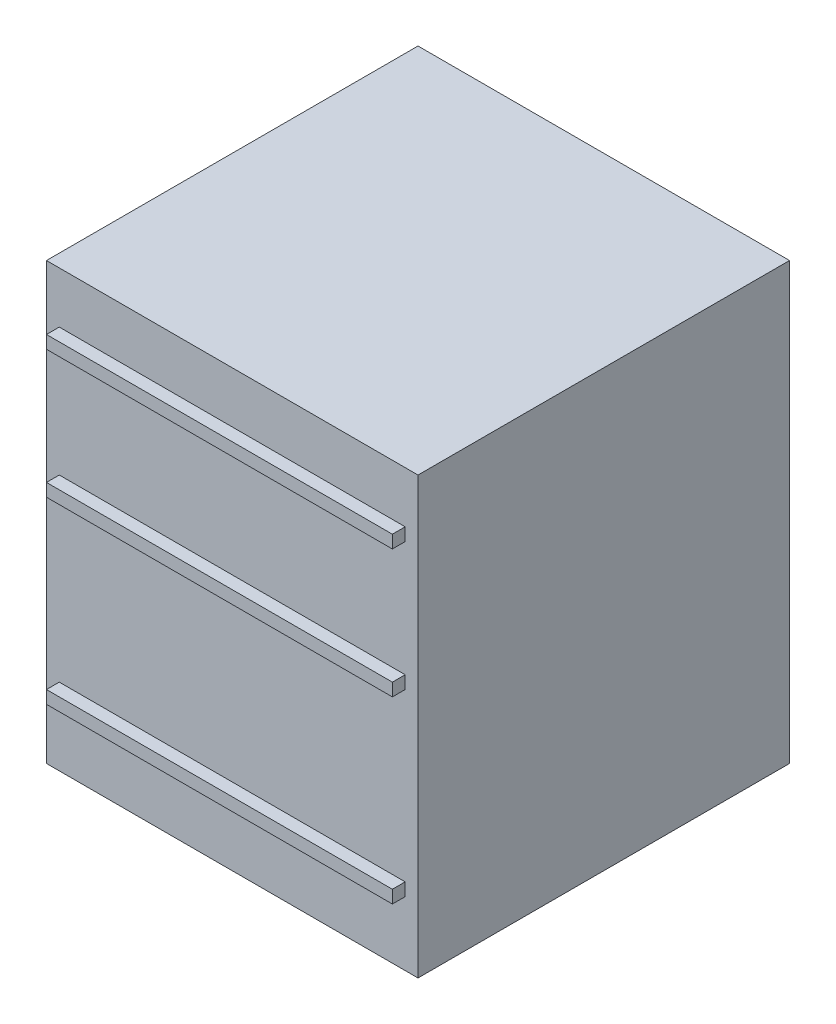
ISO-10303-21;
HEADER;
FILE_DESCRIPTION(('STEP AP214'),'2;1');
FILE_NAME('part.step','',(''),(''),'','','');
FILE_SCHEMA(('AUTOMOTIVE_DESIGN { 1 0 10303 214 1 1 1 1 }'));
ENDSEC;
DATA;
#1=APPLICATION_CONTEXT('core data for automotive mechanical design processes');
#2=APPLICATION_PROTOCOL_DEFINITION('international standard','automotive_design',2000,#1);
#3=PRODUCT_CONTEXT('',#1,'mechanical');
#4=PRODUCT('Part','Part','',(#3));
#5=PRODUCT_RELATED_PRODUCT_CATEGORY('part','',(#4));
#6=PRODUCT_DEFINITION_FORMATION('','',#4);
#7=PRODUCT_DEFINITION_CONTEXT('part definition',#1,'design');
#8=PRODUCT_DEFINITION('design','',#6,#7);
#9=PRODUCT_DEFINITION_SHAPE('','',#8);
#10=(LENGTH_UNIT() NAMED_UNIT(*) SI_UNIT(.MILLI.,.METRE.));
#11=(NAMED_UNIT(*) PLANE_ANGLE_UNIT() SI_UNIT($,.RADIAN.));
#12=(NAMED_UNIT(*) SI_UNIT($,.STERADIAN.) SOLID_ANGLE_UNIT());
#13=UNCERTAINTY_MEASURE_WITH_UNIT(LENGTH_MEASURE(1.E-05),#10,'distance_accuracy_value','');
#14=(GEOMETRIC_REPRESENTATION_CONTEXT(3) GLOBAL_UNCERTAINTY_ASSIGNED_CONTEXT((#13)) GLOBAL_UNIT_ASSIGNED_CONTEXT((#10,
#11,#12)) REPRESENTATION_CONTEXT('',''));
#15=CARTESIAN_POINT('',(0.,0.,0.));
#16=DIRECTION('',(0.,0.,1.));
#17=DIRECTION('',(1.,0.,0.));
#18=AXIS2_PLACEMENT_3D('',#15,#16,#17);
#19=CARTESIAN_POINT('',(-368.3,863.6,368.3));
#20=DIRECTION('',(0.,0.,-1.));
#21=DIRECTION('',(-1.,0.,0.));
#22=AXIS2_PLACEMENT_3D('',#19,#20,#21);
#23=PLANE('',#22);
#24=DIRECTION('',(0.,-1.,0.));
#25=VECTOR('',#24,1.);
#26=CARTESIAN_POINT('',(-342.9,508.,368.3));
#27=LINE('',#26,#25);
#28=CARTESIAN_POINT('',(-342.9,508.,368.3));
#29=VERTEX_POINT('',#28);
#30=CARTESIAN_POINT('',(-342.9,482.6,368.3));
#31=VERTEX_POINT('',#30);
#32=EDGE_CURVE('E167',#29,#31,#27,.T.);
#33=ORIENTED_EDGE('',*,*,#32,.F.);
#34=DIRECTION('',(-1.,0.,0.));
#35=VECTOR('',#34,1.);
#36=CARTESIAN_POINT('',(-342.9,508.,368.3));
#37=LINE('',#36,#35);
#38=CARTESIAN_POINT('',(342.9,508.,368.3));
#39=VERTEX_POINT('',#38);
#40=EDGE_CURVE('E180',#39,#29,#37,.T.);
#41=ORIENTED_EDGE('',*,*,#40,.F.);
#42=DIRECTION('',(0.,1.,0.));
#43=VECTOR('',#42,1.);
#44=CARTESIAN_POINT('',(342.9,508.,368.3));
#45=LINE('',#44,#43);
#46=CARTESIAN_POINT('',(342.9,482.6,368.3));
#47=VERTEX_POINT('',#46);
#48=EDGE_CURVE('E189',#47,#39,#45,.T.);
#49=ORIENTED_EDGE('',*,*,#48,.F.);
#50=DIRECTION('',(1.,0.,0.));
#51=VECTOR('',#50,1.);
#52=CARTESIAN_POINT('',(-342.9,482.6,368.3));
#53=LINE('',#52,#51);
#54=EDGE_CURVE('E170',#31,#47,#53,.T.);
#55=ORIENTED_EDGE('',*,*,#54,.F.);
#56=EDGE_LOOP('',(#33,#41,#49,#55));
#57=FACE_BOUND('',#56,.T.);
#58=DIRECTION('',(1.,0.,0.));
#59=VECTOR('',#58,1.);
#60=CARTESIAN_POINT('',(-368.3,0.,368.3));
#61=LINE('',#60,#59);
#62=CARTESIAN_POINT('',(-368.3,0.,368.3));
#63=VERTEX_POINT('',#62);
#64=CARTESIAN_POINT('',(368.3,0.,368.3));
#65=VERTEX_POINT('',#64);
#66=EDGE_CURVE('E243',#63,#65,#61,.T.);
#67=ORIENTED_EDGE('',*,*,#66,.T.);
#68=DIRECTION('',(0.,-1.,0.));
#69=VECTOR('',#68,1.);
#70=CARTESIAN_POINT('',(368.3,863.6,368.3));
#71=LINE('',#70,#69);
#72=CARTESIAN_POINT('',(368.3,863.6,368.3));
#73=VERTEX_POINT('',#72);
#74=EDGE_CURVE('E249',#73,#65,#71,.T.);
#75=ORIENTED_EDGE('',*,*,#74,.F.);
#76=DIRECTION('',(1.,0.,0.));
#77=VECTOR('',#76,1.);
#78=CARTESIAN_POINT('',(-368.3,863.6,368.3));
#79=LINE('',#78,#77);
#80=CARTESIAN_POINT('',(-368.3,863.6,368.3));
#81=VERTEX_POINT('',#80);
#82=EDGE_CURVE('E247',#81,#73,#79,.T.);
#83=ORIENTED_EDGE('',*,*,#82,.F.);
#84=DIRECTION('',(0.,-1.,0.));
#85=VECTOR('',#84,1.);
#86=CARTESIAN_POINT('',(-368.3,863.6,368.3));
#87=LINE('',#86,#85);
#88=EDGE_CURVE('E259',#81,#63,#87,.T.);
#89=ORIENTED_EDGE('',*,*,#88,.T.);
#90=EDGE_LOOP('',(#67,#75,#83,#89));
#91=FACE_BOUND('',#90,.T.);
#92=DIRECTION('',(0.,-1.,0.));
#93=VECTOR('',#92,1.);
#94=CARTESIAN_POINT('',(-342.9,762.,368.3));
#95=LINE('',#94,#93);
#96=CARTESIAN_POINT('',(-342.9,762.,368.3));
#97=VERTEX_POINT('',#96);
#98=CARTESIAN_POINT('',(-342.9,736.6,368.3));
#99=VERTEX_POINT('',#98);
#100=EDGE_CURVE('E205',#97,#99,#95,.T.);
#101=ORIENTED_EDGE('',*,*,#100,.F.);
#102=DIRECTION('',(-1.,0.,0.));
#103=VECTOR('',#102,1.);
#104=CARTESIAN_POINT('',(-342.9,762.,368.3));
#105=LINE('',#104,#103);
#106=CARTESIAN_POINT('',(342.9,762.,368.3));
#107=VERTEX_POINT('',#106);
#108=EDGE_CURVE('E210',#107,#97,#105,.T.);
#109=ORIENTED_EDGE('',*,*,#108,.F.);
#110=DIRECTION('',(0.,1.,0.));
#111=VECTOR('',#110,1.);
#112=CARTESIAN_POINT('',(342.9,762.,368.3));
#113=LINE('',#112,#111);
#114=CARTESIAN_POINT('',(342.9,736.6,368.3));
#115=VERTEX_POINT('',#114);
#116=EDGE_CURVE('E222',#115,#107,#113,.T.);
#117=ORIENTED_EDGE('',*,*,#116,.F.);
#118=DIRECTION('',(1.,0.,0.));
#119=VECTOR('',#118,1.);
#120=CARTESIAN_POINT('',(-342.9,736.6,368.3));
#121=LINE('',#120,#119);
#122=EDGE_CURVE('E219',#99,#115,#121,.T.);
#123=ORIENTED_EDGE('',*,*,#122,.F.);
#124=EDGE_LOOP('',(#101,#109,#117,#123));
#125=FACE_BOUND('',#124,.T.);
#126=DIRECTION('',(0.,-1.,0.));
#127=VECTOR('',#126,1.);
#128=CARTESIAN_POINT('',(-342.9,152.4,368.3));
#129=LINE('',#128,#127);
#130=CARTESIAN_POINT('',(-342.9,152.4,368.3));
#131=VERTEX_POINT('',#130);
#132=CARTESIAN_POINT('',(-342.9,127.,368.3));
#133=VERTEX_POINT('',#132);
#134=EDGE_CURVE('E166',#131,#133,#129,.T.);
#135=ORIENTED_EDGE('',*,*,#134,.F.);
#136=DIRECTION('',(-1.,0.,0.));
#137=VECTOR('',#136,1.);
#138=CARTESIAN_POINT('',(-342.9,152.4,368.3));
#139=LINE('',#138,#137);
#140=CARTESIAN_POINT('',(342.9,152.4,368.3));
#141=VERTEX_POINT('',#140);
#142=EDGE_CURVE('E163',#141,#131,#139,.T.);
#143=ORIENTED_EDGE('',*,*,#142,.F.);
#144=DIRECTION('',(0.,1.,0.));
#145=VECTOR('',#144,1.);
#146=CARTESIAN_POINT('',(342.9,152.4,368.3));
#147=LINE('',#146,#145);
#148=CARTESIAN_POINT('',(342.9,127.,368.3));
#149=VERTEX_POINT('',#148);
#150=EDGE_CURVE('E53',#149,#141,#147,.T.);
#151=ORIENTED_EDGE('',*,*,#150,.F.);
#152=DIRECTION('',(1.,0.,0.));
#153=VECTOR('',#152,1.);
#154=CARTESIAN_POINT('',(-342.9,127.,368.3));
#155=LINE('',#154,#153);
#156=EDGE_CURVE('E48',#133,#149,#155,.T.);
#157=ORIENTED_EDGE('',*,*,#156,.F.);
#158=EDGE_LOOP('',(#135,#143,#151,#157));
#159=FACE_BOUND('',#158,.T.);
#160=ADVANCED_FACE('F33',(#57,#91,#125,#159),#23,.F.);
#161=CARTESIAN_POINT('',(368.3,863.6,368.3));
#162=DIRECTION('',(-1.,0.,0.));
#163=DIRECTION('',(0.,0.,1.));
#164=AXIS2_PLACEMENT_3D('',#161,#162,#163);
#165=PLANE('',#164);
#166=DIRECTION('',(0.,0.,-1.));
#167=VECTOR('',#166,1.);
#168=CARTESIAN_POINT('',(368.3,0.,368.3));
#169=LINE('',#168,#167);
#170=CARTESIAN_POINT('',(368.3,0.,-368.3));
#171=VERTEX_POINT('',#170);
#172=EDGE_CURVE('E238',#65,#171,#169,.T.);
#173=ORIENTED_EDGE('',*,*,#172,.T.);
#174=DIRECTION('',(0.,-1.,0.));
#175=VECTOR('',#174,1.);
#176=CARTESIAN_POINT('',(368.3,863.6,-368.3));
#177=LINE('',#176,#175);
#178=CARTESIAN_POINT('',(368.3,863.6,-368.3));
#179=VERTEX_POINT('',#178);
#180=EDGE_CURVE('E11',#179,#171,#177,.T.);
#181=ORIENTED_EDGE('',*,*,#180,.F.);
#182=DIRECTION('',(0.,0.,-1.));
#183=VECTOR('',#182,1.);
#184=CARTESIAN_POINT('',(368.3,863.6,368.3));
#185=LINE('',#184,#183);
#186=EDGE_CURVE('E239',#73,#179,#185,.T.);
#187=ORIENTED_EDGE('',*,*,#186,.F.);
#188=ORIENTED_EDGE('',*,*,#74,.T.);
#189=EDGE_LOOP('',(#173,#181,#187,#188));
#190=FACE_BOUND('',#189,.T.);
#191=ADVANCED_FACE('F35',(#190),#165,.F.);
#192=CARTESIAN_POINT('',(-368.3,863.6,-368.3));
#193=DIRECTION('',(0.,0.,1.));
#194=DIRECTION('',(1.,0.,0.));
#195=AXIS2_PLACEMENT_3D('',#192,#193,#194);
#196=PLANE('',#195);
#197=DIRECTION('',(-1.,0.,0.));
#198=VECTOR('',#197,1.);
#199=CARTESIAN_POINT('',(-368.3,0.,-368.3));
#200=LINE('',#199,#198);
#201=CARTESIAN_POINT('',(-368.3,0.,-368.3));
#202=VERTEX_POINT('',#201);
#203=EDGE_CURVE('E252',#171,#202,#200,.T.);
#204=ORIENTED_EDGE('',*,*,#203,.T.);
#205=DIRECTION('',(0.,-1.,0.));
#206=VECTOR('',#205,1.);
#207=CARTESIAN_POINT('',(-368.3,863.6,-368.3));
#208=LINE('',#207,#206);
#209=CARTESIAN_POINT('',(-368.3,863.6,-368.3));
#210=VERTEX_POINT('',#209);
#211=EDGE_CURVE('E41',#210,#202,#208,.T.);
#212=ORIENTED_EDGE('',*,*,#211,.F.);
#213=DIRECTION('',(-1.,0.,0.));
#214=VECTOR('',#213,1.);
#215=CARTESIAN_POINT('',(-368.3,863.6,-368.3));
#216=LINE('',#215,#214);
#217=EDGE_CURVE('E242',#179,#210,#216,.T.);
#218=ORIENTED_EDGE('',*,*,#217,.F.);
#219=ORIENTED_EDGE('',*,*,#180,.T.);
#220=EDGE_LOOP('',(#204,#212,#218,#219));
#221=FACE_BOUND('',#220,.T.);
#222=ADVANCED_FACE('F282',(#221),#196,.F.);
#223=CARTESIAN_POINT('',(-368.3,863.6,368.3));
#224=DIRECTION('',(1.,0.,0.));
#225=DIRECTION('',(0.,0.,-1.));
#226=AXIS2_PLACEMENT_3D('',#223,#224,#225);
#227=PLANE('',#226);
#228=DIRECTION('',(0.,0.,1.));
#229=VECTOR('',#228,1.);
#230=CARTESIAN_POINT('',(-368.3,0.,368.3));
#231=LINE('',#230,#229);
#232=EDGE_CURVE('E254',#202,#63,#231,.T.);
#233=ORIENTED_EDGE('',*,*,#232,.T.);
#234=ORIENTED_EDGE('',*,*,#88,.F.);
#235=DIRECTION('',(0.,0.,1.));
#236=VECTOR('',#235,1.);
#237=CARTESIAN_POINT('',(-368.3,863.6,368.3));
#238=LINE('',#237,#236);
#239=EDGE_CURVE('E245',#210,#81,#238,.T.);
#240=ORIENTED_EDGE('',*,*,#239,.F.);
#241=ORIENTED_EDGE('',*,*,#211,.T.);
#242=EDGE_LOOP('',(#233,#234,#240,#241));
#243=FACE_BOUND('',#242,.T.);
#244=ADVANCED_FACE('F266',(#243),#227,.F.);
#245=CARTESIAN_POINT('',(0.,863.6,0.));
#246=DIRECTION('',(0.,-1.,0.));
#247=DIRECTION('',(0.,0.,-1.));
#248=AXIS2_PLACEMENT_3D('',#245,#246,#247);
#249=PLANE('',#248);
#250=ORIENTED_EDGE('',*,*,#186,.T.);
#251=ORIENTED_EDGE('',*,*,#217,.T.);
#252=ORIENTED_EDGE('',*,*,#239,.T.);
#253=ORIENTED_EDGE('',*,*,#82,.T.);
#254=EDGE_LOOP('',(#250,#251,#252,#253));
#255=FACE_BOUND('',#254,.T.);
#256=ADVANCED_FACE('F281',(#255),#249,.F.);
#257=CARTESIAN_POINT('',(0.,0.,0.));
#258=DIRECTION('',(0.,-1.,0.));
#259=DIRECTION('',(0.,0.,-1.));
#260=AXIS2_PLACEMENT_3D('',#257,#258,#259);
#261=PLANE('',#260);
#262=ORIENTED_EDGE('',*,*,#172,.F.);
#263=ORIENTED_EDGE('',*,*,#66,.F.);
#264=ORIENTED_EDGE('',*,*,#232,.F.);
#265=ORIENTED_EDGE('',*,*,#203,.F.);
#266=EDGE_LOOP('',(#262,#263,#264,#265));
#267=FACE_BOUND('',#266,.T.);
#268=ADVANCED_FACE('F272',(#267),#261,.T.);
#269=CARTESIAN_POINT('',(-342.9,762.,393.7));
#270=DIRECTION('',(1.,0.,0.));
#271=DIRECTION('',(0.,0.,-1.));
#272=AXIS2_PLACEMENT_3D('',#269,#270,#271);
#273=PLANE('',#272);
#274=ORIENTED_EDGE('',*,*,#100,.T.);
#275=DIRECTION('',(0.,0.,-1.));
#276=VECTOR('',#275,1.);
#277=CARTESIAN_POINT('',(-342.9,736.6,393.7));
#278=LINE('',#277,#276);
#279=CARTESIAN_POINT('',(-342.9,736.6,393.7));
#280=VERTEX_POINT('',#279);
#281=EDGE_CURVE('E235',#280,#99,#278,.T.);
#282=ORIENTED_EDGE('',*,*,#281,.F.);
#283=DIRECTION('',(0.,-1.,0.));
#284=VECTOR('',#283,1.);
#285=CARTESIAN_POINT('',(-342.9,762.,393.7));
#286=LINE('',#285,#284);
#287=CARTESIAN_POINT('',(-342.9,762.,393.7));
#288=VERTEX_POINT('',#287);
#289=EDGE_CURVE('E206',#288,#280,#286,.T.);
#290=ORIENTED_EDGE('',*,*,#289,.F.);
#291=DIRECTION('',(0.,0.,-1.));
#292=VECTOR('',#291,1.);
#293=CARTESIAN_POINT('',(-342.9,762.,393.7));
#294=LINE('',#293,#292);
#295=EDGE_CURVE('E216',#288,#97,#294,.T.);
#296=ORIENTED_EDGE('',*,*,#295,.T.);
#297=EDGE_LOOP('',(#274,#282,#290,#296));
#298=FACE_BOUND('',#297,.T.);
#299=ADVANCED_FACE('F299',(#298),#273,.F.);
#300=CARTESIAN_POINT('',(-342.9,736.6,393.7));
#301=DIRECTION('',(0.,1.,0.));
#302=DIRECTION('',(0.,0.,1.));
#303=AXIS2_PLACEMENT_3D('',#300,#301,#302);
#304=PLANE('',#303);
#305=ORIENTED_EDGE('',*,*,#122,.T.);
#306=DIRECTION('',(0.,0.,-1.));
#307=VECTOR('',#306,1.);
#308=CARTESIAN_POINT('',(342.9,736.6,393.7));
#309=LINE('',#308,#307);
#310=CARTESIAN_POINT('',(342.9,736.6,393.7));
#311=VERTEX_POINT('',#310);
#312=EDGE_CURVE('E232',#311,#115,#309,.T.);
#313=ORIENTED_EDGE('',*,*,#312,.F.);
#314=DIRECTION('',(1.,0.,0.));
#315=VECTOR('',#314,1.);
#316=CARTESIAN_POINT('',(-342.9,736.6,393.7));
#317=LINE('',#316,#315);
#318=EDGE_CURVE('E209',#280,#311,#317,.T.);
#319=ORIENTED_EDGE('',*,*,#318,.F.);
#320=ORIENTED_EDGE('',*,*,#281,.T.);
#321=EDGE_LOOP('',(#305,#313,#319,#320));
#322=FACE_BOUND('',#321,.T.);
#323=ADVANCED_FACE('F304',(#322),#304,.F.);
#324=CARTESIAN_POINT('',(342.9,762.,393.7));
#325=DIRECTION('',(-1.,0.,0.));
#326=DIRECTION('',(0.,0.,1.));
#327=AXIS2_PLACEMENT_3D('',#324,#325,#326);
#328=PLANE('',#327);
#329=ORIENTED_EDGE('',*,*,#116,.T.);
#330=DIRECTION('',(0.,0.,-1.));
#331=VECTOR('',#330,1.);
#332=CARTESIAN_POINT('',(342.9,762.,393.7));
#333=LINE('',#332,#331);
#334=CARTESIAN_POINT('',(342.9,762.,393.7));
#335=VERTEX_POINT('',#334);
#336=EDGE_CURVE('E229',#335,#107,#333,.T.);
#337=ORIENTED_EDGE('',*,*,#336,.F.);
#338=DIRECTION('',(0.,1.,0.));
#339=VECTOR('',#338,1.);
#340=CARTESIAN_POINT('',(342.9,762.,393.7));
#341=LINE('',#340,#339);
#342=EDGE_CURVE('E212',#311,#335,#341,.T.);
#343=ORIENTED_EDGE('',*,*,#342,.F.);
#344=ORIENTED_EDGE('',*,*,#312,.T.);
#345=EDGE_LOOP('',(#329,#337,#343,#344));
#346=FACE_BOUND('',#345,.T.);
#347=ADVANCED_FACE('F308',(#346),#328,.F.);
#348=CARTESIAN_POINT('',(-342.9,762.,393.7));
#349=DIRECTION('',(0.,-1.,0.));
#350=DIRECTION('',(0.,0.,-1.));
#351=AXIS2_PLACEMENT_3D('',#348,#349,#350);
#352=PLANE('',#351);
#353=ORIENTED_EDGE('',*,*,#108,.T.);
#354=ORIENTED_EDGE('',*,*,#295,.F.);
#355=DIRECTION('',(-1.,0.,0.));
#356=VECTOR('',#355,1.);
#357=CARTESIAN_POINT('',(-342.9,762.,393.7));
#358=LINE('',#357,#356);
#359=EDGE_CURVE('E214',#335,#288,#358,.T.);
#360=ORIENTED_EDGE('',*,*,#359,.F.);
#361=ORIENTED_EDGE('',*,*,#336,.T.);
#362=EDGE_LOOP('',(#353,#354,#360,#361));
#363=FACE_BOUND('',#362,.T.);
#364=ADVANCED_FACE('F312',(#363),#352,.F.);
#365=CARTESIAN_POINT('',(0.,0.,393.7));
#366=DIRECTION('',(0.,0.,1.));
#367=DIRECTION('',(1.,0.,0.));
#368=AXIS2_PLACEMENT_3D('',#365,#366,#367);
#369=PLANE('',#368);
#370=ORIENTED_EDGE('',*,*,#289,.T.);
#371=ORIENTED_EDGE('',*,*,#318,.T.);
#372=ORIENTED_EDGE('',*,*,#342,.T.);
#373=ORIENTED_EDGE('',*,*,#359,.T.);
#374=EDGE_LOOP('',(#370,#371,#372,#373));
#375=FACE_BOUND('',#374,.T.);
#376=ADVANCED_FACE('F316',(#375),#369,.T.);
#377=CARTESIAN_POINT('',(-342.9,508.,393.7));
#378=DIRECTION('',(1.,0.,0.));
#379=DIRECTION('',(0.,0.,-1.));
#380=AXIS2_PLACEMENT_3D('',#377,#378,#379);
#381=PLANE('',#380);
#382=ORIENTED_EDGE('',*,*,#32,.T.);
#383=DIRECTION('',(0.,0.,-1.));
#384=VECTOR('',#383,1.);
#385=CARTESIAN_POINT('',(-342.9,482.6,393.7));
#386=LINE('',#385,#384);
#387=CARTESIAN_POINT('',(-342.9,482.6,393.7));
#388=VERTEX_POINT('',#387);
#389=EDGE_CURVE('E202',#388,#31,#386,.T.);
#390=ORIENTED_EDGE('',*,*,#389,.F.);
#391=DIRECTION('',(0.,-1.,0.));
#392=VECTOR('',#391,1.);
#393=CARTESIAN_POINT('',(-342.9,508.,393.7));
#394=LINE('',#393,#392);
#395=CARTESIAN_POINT('',(-342.9,508.,393.7));
#396=VERTEX_POINT('',#395);
#397=EDGE_CURVE('E176',#396,#388,#394,.T.);
#398=ORIENTED_EDGE('',*,*,#397,.F.);
#399=DIRECTION('',(0.,0.,-1.));
#400=VECTOR('',#399,1.);
#401=CARTESIAN_POINT('',(-342.9,508.,393.7));
#402=LINE('',#401,#400);
#403=EDGE_CURVE('E185',#396,#29,#402,.T.);
#404=ORIENTED_EDGE('',*,*,#403,.T.);
#405=EDGE_LOOP('',(#382,#390,#398,#404));
#406=FACE_BOUND('',#405,.T.);
#407=ADVANCED_FACE('F320',(#406),#381,.F.);
#408=CARTESIAN_POINT('',(-342.9,482.6,393.7));
#409=DIRECTION('',(0.,1.,0.));
#410=DIRECTION('',(0.,0.,1.));
#411=AXIS2_PLACEMENT_3D('',#408,#409,#410);
#412=PLANE('',#411);
#413=ORIENTED_EDGE('',*,*,#54,.T.);
#414=DIRECTION('',(0.,0.,-1.));
#415=VECTOR('',#414,1.);
#416=CARTESIAN_POINT('',(342.9,482.6,393.7));
#417=LINE('',#416,#415);
#418=CARTESIAN_POINT('',(342.9,482.6,393.7));
#419=VERTEX_POINT('',#418);
#420=EDGE_CURVE('E199',#419,#47,#417,.T.);
#421=ORIENTED_EDGE('',*,*,#420,.F.);
#422=DIRECTION('',(1.,0.,0.));
#423=VECTOR('',#422,1.);
#424=CARTESIAN_POINT('',(-342.9,482.6,393.7));
#425=LINE('',#424,#423);
#426=EDGE_CURVE('E179',#388,#419,#425,.T.);
#427=ORIENTED_EDGE('',*,*,#426,.F.);
#428=ORIENTED_EDGE('',*,*,#389,.T.);
#429=EDGE_LOOP('',(#413,#421,#427,#428));
#430=FACE_BOUND('',#429,.T.);
#431=ADVANCED_FACE('F324',(#430),#412,.F.);
#432=CARTESIAN_POINT('',(342.9,508.,393.7));
#433=DIRECTION('',(-1.,0.,0.));
#434=DIRECTION('',(0.,0.,1.));
#435=AXIS2_PLACEMENT_3D('',#432,#433,#434);
#436=PLANE('',#435);
#437=ORIENTED_EDGE('',*,*,#48,.T.);
#438=DIRECTION('',(0.,0.,-1.));
#439=VECTOR('',#438,1.);
#440=CARTESIAN_POINT('',(342.9,508.,393.7));
#441=LINE('',#440,#439);
#442=CARTESIAN_POINT('',(342.9,508.,393.7));
#443=VERTEX_POINT('',#442);
#444=EDGE_CURVE('E196',#443,#39,#441,.T.);
#445=ORIENTED_EDGE('',*,*,#444,.F.);
#446=DIRECTION('',(0.,1.,0.));
#447=VECTOR('',#446,1.);
#448=CARTESIAN_POINT('',(342.9,508.,393.7));
#449=LINE('',#448,#447);
#450=EDGE_CURVE('E182',#419,#443,#449,.T.);
#451=ORIENTED_EDGE('',*,*,#450,.F.);
#452=ORIENTED_EDGE('',*,*,#420,.T.);
#453=EDGE_LOOP('',(#437,#445,#451,#452));
#454=FACE_BOUND('',#453,.T.);
#455=ADVANCED_FACE('F328',(#454),#436,.F.);
#456=CARTESIAN_POINT('',(-342.9,508.,393.7));
#457=DIRECTION('',(0.,-1.,0.));
#458=DIRECTION('',(0.,0.,-1.));
#459=AXIS2_PLACEMENT_3D('',#456,#457,#458);
#460=PLANE('',#459);
#461=ORIENTED_EDGE('',*,*,#40,.T.);
#462=ORIENTED_EDGE('',*,*,#403,.F.);
#463=DIRECTION('',(-1.,0.,0.));
#464=VECTOR('',#463,1.);
#465=CARTESIAN_POINT('',(-342.9,508.,393.7));
#466=LINE('',#465,#464);
#467=EDGE_CURVE('E184',#443,#396,#466,.T.);
#468=ORIENTED_EDGE('',*,*,#467,.F.);
#469=ORIENTED_EDGE('',*,*,#444,.T.);
#470=EDGE_LOOP('',(#461,#462,#468,#469));
#471=FACE_BOUND('',#470,.T.);
#472=ADVANCED_FACE('F332',(#471),#460,.F.);
#473=CARTESIAN_POINT('',(0.,0.,393.7));
#474=DIRECTION('',(0.,0.,1.));
#475=DIRECTION('',(1.,0.,0.));
#476=AXIS2_PLACEMENT_3D('',#473,#474,#475);
#477=PLANE('',#476);
#478=ORIENTED_EDGE('',*,*,#397,.T.);
#479=ORIENTED_EDGE('',*,*,#426,.T.);
#480=ORIENTED_EDGE('',*,*,#450,.T.);
#481=ORIENTED_EDGE('',*,*,#467,.T.);
#482=EDGE_LOOP('',(#478,#479,#480,#481));
#483=FACE_BOUND('',#482,.T.);
#484=ADVANCED_FACE('F336',(#483),#477,.T.);
#485=CARTESIAN_POINT('',(-342.9,152.4,393.7));
#486=DIRECTION('',(1.,0.,0.));
#487=DIRECTION('',(0.,0.,-1.));
#488=AXIS2_PLACEMENT_3D('',#485,#486,#487);
#489=PLANE('',#488);
#490=ORIENTED_EDGE('',*,*,#134,.T.);
#491=DIRECTION('',(0.,0.,-1.));
#492=VECTOR('',#491,1.);
#493=CARTESIAN_POINT('',(-342.9,127.,393.7));
#494=LINE('',#493,#492);
#495=CARTESIAN_POINT('',(-342.9,127.,393.7));
#496=VERTEX_POINT('',#495);
#497=EDGE_CURVE('E147',#496,#133,#494,.T.);
#498=ORIENTED_EDGE('',*,*,#497,.F.);
#499=DIRECTION('',(0.,-1.,0.));
#500=VECTOR('',#499,1.);
#501=CARTESIAN_POINT('',(-342.9,152.4,393.7));
#502=LINE('',#501,#500);
#503=CARTESIAN_POINT('',(-342.9,152.4,393.7));
#504=VERTEX_POINT('',#503);
#505=EDGE_CURVE('E154',#504,#496,#502,.T.);
#506=ORIENTED_EDGE('',*,*,#505,.F.);
#507=DIRECTION('',(0.,0.,-1.));
#508=VECTOR('',#507,1.);
#509=CARTESIAN_POINT('',(-342.9,152.4,393.7));
#510=LINE('',#509,#508);
#511=EDGE_CURVE('E476',#504,#131,#510,.T.);
#512=ORIENTED_EDGE('',*,*,#511,.T.);
#513=EDGE_LOOP('',(#490,#498,#506,#512));
#514=FACE_BOUND('',#513,.T.);
#515=ADVANCED_FACE('F165',(#514),#489,.F.);
#516=CARTESIAN_POINT('',(-342.9,127.,393.7));
#517=DIRECTION('',(0.,1.,0.));
#518=DIRECTION('',(0.,0.,1.));
#519=AXIS2_PLACEMENT_3D('',#516,#517,#518);
#520=PLANE('',#519);
#521=ORIENTED_EDGE('',*,*,#156,.T.);
#522=DIRECTION('',(0.,0.,-1.));
#523=VECTOR('',#522,1.);
#524=CARTESIAN_POINT('',(342.9,127.,393.7));
#525=LINE('',#524,#523);
#526=CARTESIAN_POINT('',(342.9,127.,393.7));
#527=VERTEX_POINT('',#526);
#528=EDGE_CURVE('E150',#527,#149,#525,.T.);
#529=ORIENTED_EDGE('',*,*,#528,.F.);
#530=DIRECTION('',(1.,0.,0.));
#531=VECTOR('',#530,1.);
#532=CARTESIAN_POINT('',(-342.9,127.,393.7));
#533=LINE('',#532,#531);
#534=EDGE_CURVE('E143',#496,#527,#533,.T.);
#535=ORIENTED_EDGE('',*,*,#534,.F.);
#536=ORIENTED_EDGE('',*,*,#497,.T.);
#537=EDGE_LOOP('',(#521,#529,#535,#536));
#538=FACE_BOUND('',#537,.T.);
#539=ADVANCED_FACE('F145',(#538),#520,.F.);
#540=CARTESIAN_POINT('',(342.9,152.4,393.7));
#541=DIRECTION('',(-1.,0.,0.));
#542=DIRECTION('',(0.,-1.,0.));
#543=AXIS2_PLACEMENT_3D('',#540,#541,#542);
#544=PLANE('',#543);
#545=ORIENTED_EDGE('',*,*,#150,.T.);
#546=DIRECTION('',(0.,0.,-1.));
#547=VECTOR('',#546,1.);
#548=CARTESIAN_POINT('',(342.9,152.4,393.7));
#549=LINE('',#548,#547);
#550=CARTESIAN_POINT('',(342.9,152.4,393.7));
#551=VERTEX_POINT('',#550);
#552=EDGE_CURVE('E172',#551,#141,#549,.T.);
#553=ORIENTED_EDGE('',*,*,#552,.F.);
#554=DIRECTION('',(0.,1.,0.));
#555=VECTOR('',#554,1.);
#556=CARTESIAN_POINT('',(342.9,152.4,393.7));
#557=LINE('',#556,#555);
#558=EDGE_CURVE('E153',#527,#551,#557,.T.);
#559=ORIENTED_EDGE('',*,*,#558,.F.);
#560=ORIENTED_EDGE('',*,*,#528,.T.);
#561=EDGE_LOOP('',(#545,#553,#559,#560));
#562=FACE_BOUND('',#561,.T.);
#563=ADVANCED_FACE('F345',(#562),#544,.F.);
#564=CARTESIAN_POINT('',(-342.9,152.4,393.7));
#565=DIRECTION('',(0.,-1.,0.));
#566=DIRECTION('',(0.,0.,-1.));
#567=AXIS2_PLACEMENT_3D('',#564,#565,#566);
#568=PLANE('',#567);
#569=ORIENTED_EDGE('',*,*,#142,.T.);
#570=ORIENTED_EDGE('',*,*,#511,.F.);
#571=DIRECTION('',(-1.,0.,0.));
#572=VECTOR('',#571,1.);
#573=CARTESIAN_POINT('',(-342.9,152.4,393.7));
#574=LINE('',#573,#572);
#575=EDGE_CURVE('E159',#551,#504,#574,.T.);
#576=ORIENTED_EDGE('',*,*,#575,.F.);
#577=ORIENTED_EDGE('',*,*,#552,.T.);
#578=EDGE_LOOP('',(#569,#570,#576,#577));
#579=FACE_BOUND('',#578,.T.);
#580=ADVANCED_FACE('F348',(#579),#568,.F.);
#581=CARTESIAN_POINT('',(0.,0.,393.7));
#582=DIRECTION('',(0.,0.,1.));
#583=DIRECTION('',(1.,0.,0.));
#584=AXIS2_PLACEMENT_3D('',#581,#582,#583);
#585=PLANE('',#584);
#586=ORIENTED_EDGE('',*,*,#505,.T.);
#587=ORIENTED_EDGE('',*,*,#534,.T.);
#588=ORIENTED_EDGE('',*,*,#558,.T.);
#589=ORIENTED_EDGE('',*,*,#575,.T.);
#590=EDGE_LOOP('',(#586,#587,#588,#589));
#591=FACE_BOUND('',#590,.T.);
#592=ADVANCED_FACE('F157',(#591),#585,.T.);
#593=CLOSED_SHELL('',(#160,#191,#222,#244,#256,#268,#299,#323,#347,#364,#376,#407,#431,#455,
#472,#484,#515,#539,#563,#580,#592));
#594=MANIFOLD_SOLID_BREP('B2',#593);
#595=ADVANCED_BREP_SHAPE_REPRESENTATION('',(#18,#594),#14);
#596=SHAPE_DEFINITION_REPRESENTATION(#9,#595);
ENDSEC;
END-ISO-10303-21;
